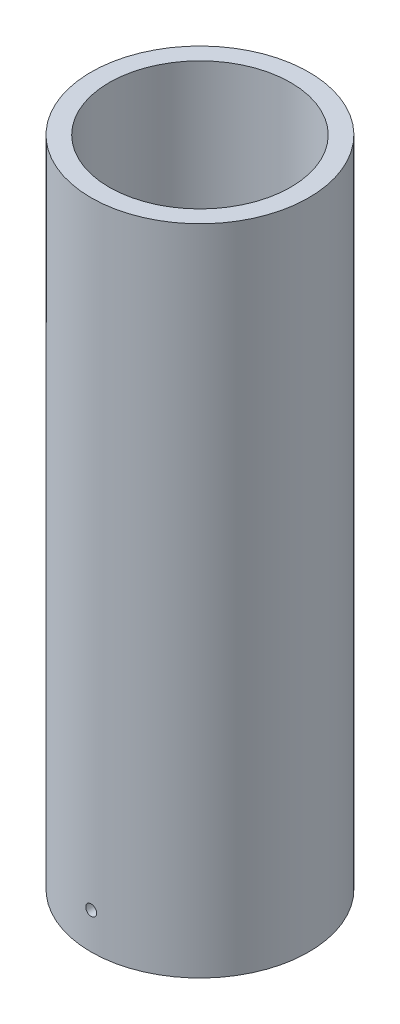
ISO-10303-21;
HEADER;
FILE_DESCRIPTION(('STEP AP214'),'2;1');
FILE_NAME('part.step','',(''),(''),'','','');
FILE_SCHEMA(('AUTOMOTIVE_DESIGN { 1 0 10303 214 1 1 1 1 }'));
ENDSEC;
DATA;
#1=APPLICATION_CONTEXT('core data for automotive mechanical design processes');
#2=APPLICATION_PROTOCOL_DEFINITION('international standard','automotive_design',2000,#1);
#3=PRODUCT_CONTEXT('',#1,'mechanical');
#4=PRODUCT('Part','Part','',(#3));
#5=PRODUCT_RELATED_PRODUCT_CATEGORY('part','',(#4));
#6=PRODUCT_DEFINITION_FORMATION('','',#4);
#7=PRODUCT_DEFINITION_CONTEXT('part definition',#1,'design');
#8=PRODUCT_DEFINITION('design','',#6,#7);
#9=PRODUCT_DEFINITION_SHAPE('','',#8);
#10=(LENGTH_UNIT() NAMED_UNIT(*) SI_UNIT(.MILLI.,.METRE.));
#11=(NAMED_UNIT(*) PLANE_ANGLE_UNIT() SI_UNIT($,.RADIAN.));
#12=(NAMED_UNIT(*) SI_UNIT($,.STERADIAN.) SOLID_ANGLE_UNIT());
#13=UNCERTAINTY_MEASURE_WITH_UNIT(LENGTH_MEASURE(1.E-05),#10,'distance_accuracy_value','');
#14=(GEOMETRIC_REPRESENTATION_CONTEXT(3) GLOBAL_UNCERTAINTY_ASSIGNED_CONTEXT((#13)) GLOBAL_UNIT_ASSIGNED_CONTEXT((#10,
#11,#12)) REPRESENTATION_CONTEXT('',''));
#15=CARTESIAN_POINT('',(0.,0.,0.));
#16=DIRECTION('',(0.,0.,1.));
#17=DIRECTION('',(1.,0.,0.));
#18=AXIS2_PLACEMENT_3D('',#15,#16,#17);
#19=CARTESIAN_POINT('',(0.,180.,0.));
#20=DIRECTION('',(0.,1.,0.));
#21=DIRECTION('',(0.,0.,1.));
#22=AXIS2_PLACEMENT_3D('',#19,#20,#21);
#23=PLANE('',#22);
#24=CARTESIAN_POINT('',(0.,180.,0.));
#25=DIRECTION('',(0.,1.,0.));
#26=DIRECTION('',(0.,0.,1.));
#27=AXIS2_PLACEMENT_3D('',#24,#25,#26);
#28=CIRCLE('',#27,30.);
#29=CARTESIAN_POINT('',(0.,180.,30.));
#30=VERTEX_POINT('',#29);
#31=EDGE_CURVE('E10',#30,#30,#28,.T.);
#32=ORIENTED_EDGE('',*,*,#31,.T.);
#33=EDGE_LOOP('',(#32));
#34=FACE_BOUND('',#33,.T.);
#35=CARTESIAN_POINT('',(0.,180.,0.));
#36=DIRECTION('',(0.,1.,0.));
#37=DIRECTION('',(0.,0.,1.));
#38=AXIS2_PLACEMENT_3D('',#35,#36,#37);
#39=CIRCLE('',#38,25.);
#40=CARTESIAN_POINT('',(0.,180.,25.));
#41=VERTEX_POINT('',#40);
#42=EDGE_CURVE('E49',#41,#41,#39,.T.);
#43=ORIENTED_EDGE('',*,*,#42,.F.);
#44=EDGE_LOOP('',(#43));
#45=FACE_BOUND('',#44,.T.);
#46=ADVANCED_FACE('F31',(#34,#45),#23,.T.);
#47=CARTESIAN_POINT('',(0.,0.,0.));
#48=DIRECTION('',(0.,1.,0.));
#49=DIRECTION('',(0.,0.,1.));
#50=AXIS2_PLACEMENT_3D('',#47,#48,#49);
#51=PLANE('',#50);
#52=CARTESIAN_POINT('',(0.,0.,0.));
#53=DIRECTION('',(0.,1.,0.));
#54=DIRECTION('',(0.,0.,1.));
#55=AXIS2_PLACEMENT_3D('',#52,#53,#54);
#56=CIRCLE('',#55,30.);
#57=CARTESIAN_POINT('',(0.,0.,30.));
#58=VERTEX_POINT('',#57);
#59=EDGE_CURVE('E44',#58,#58,#56,.T.);
#60=ORIENTED_EDGE('',*,*,#59,.F.);
#61=EDGE_LOOP('',(#60));
#62=FACE_BOUND('',#61,.T.);
#63=CARTESIAN_POINT('',(0.,0.,0.));
#64=DIRECTION('',(0.,1.,0.));
#65=DIRECTION('',(0.,0.,1.));
#66=AXIS2_PLACEMENT_3D('',#63,#64,#65);
#67=CIRCLE('',#66,25.);
#68=CARTESIAN_POINT('',(0.,0.,25.));
#69=VERTEX_POINT('',#68);
#70=EDGE_CURVE('E52',#69,#69,#67,.T.);
#71=ORIENTED_EDGE('',*,*,#70,.T.);
#72=EDGE_LOOP('',(#71));
#73=FACE_BOUND('',#72,.T.);
#74=ADVANCED_FACE('F85',(#62,#73),#51,.F.);
#75=CARTESIAN_POINT('',(0.,180.,0.));
#76=DIRECTION('',(0.,-1.,0.));
#77=DIRECTION('',(0.,0.,-1.));
#78=AXIS2_PLACEMENT_3D('',#75,#76,#77);
#79=CYLINDRICAL_SURFACE('',#78,30.);
#80=CARTESIAN_POINT('',(0.,11.5,-30.));
#81=CARTESIAN_POINT('',(-0.0841992126832857,11.4999962840397,-29.9999994982941));
#82=CARTESIAN_POINT('',(-0.168458136850032,11.4928866817366,-29.9996417281926));
#83=CARTESIAN_POINT('',(-0.33465158022757,11.4646258947893,-29.9982489069002));
#84=CARTESIAN_POINT('',(-0.416583242008779,11.4434581659315,-29.9972130577371));
#85=CARTESIAN_POINT('',(-0.575690637565501,11.3876886958403,-29.994581319066));
#86=CARTESIAN_POINT('',(-0.652868771917124,11.3530938009858,-29.9929857150113));
#87=CARTESIAN_POINT('',(-0.800301559187852,11.2714625403052,-29.9894141701653));
#88=CARTESIAN_POINT('',(-0.870557841111931,11.2244291114388,-29.987438319187));
#89=CARTESIAN_POINT('',(-1.00224448930937,11.1192029919437,-29.9833263203305));
#90=CARTESIAN_POINT('',(-1.06366700108493,11.0610004763932,-29.9811900323378));
#91=CARTESIAN_POINT('',(-1.1758756183212,10.935107951495,-29.9769991403279));
#92=CARTESIAN_POINT('',(-1.22666128928588,10.8674175547728,-29.9749445396501));
#93=CARTESIAN_POINT('',(-1.3161762583419,10.7244295509778,-29.9711477201023));
#94=CARTESIAN_POINT('',(-1.35489942324752,10.6491280997483,-29.969405660334));
#95=CARTESIAN_POINT('',(-1.41915082297219,10.4930825776006,-29.9664320766967));
#96=CARTESIAN_POINT('',(-1.44467915792307,10.4123385479899,-29.9652005489535));
#97=CARTESIAN_POINT('',(-1.4817954922831,10.2477721448386,-29.9633881722544));
#98=CARTESIAN_POINT('',(-1.4933952428733,10.1639524277984,-29.9628067748292));
#99=CARTESIAN_POINT('',(-1.5023613905524,9.99555366389491,-29.9623585750058));
#100=CARTESIAN_POINT('',(-1.49972789996418,9.9109746230292,-29.9624917669684));
#101=CARTESIAN_POINT('',(-1.48031211001844,9.74353797565118,-29.9634572162788));
#102=CARTESIAN_POINT('',(-1.46354250774894,9.66067889267851,-29.9642888462857));
#103=CARTESIAN_POINT('',(-1.41635019807595,9.49895332894273,-29.9665564507146));
#104=CARTESIAN_POINT('',(-1.38592743297957,9.42008686505241,-29.9679924276905));
#105=CARTESIAN_POINT('',(-1.31227788828427,9.26854436690631,-29.9713076019097));
#106=CARTESIAN_POINT('',(-1.26904531998985,9.19587115051146,-29.9731869994545));
#107=CARTESIAN_POINT('',(-1.17100760081353,9.05880889495858,-29.9771769840148));
#108=CARTESIAN_POINT('',(-1.11620236826096,8.99441991426925,-29.9792875726618));
#109=CARTESIAN_POINT('',(-0.996503387931563,8.87567999508416,-29.9835048437456));
#110=CARTESIAN_POINT('',(-0.931598644778624,8.82134013991281,-29.9856115193623));
#111=CARTESIAN_POINT('',(-0.793581693926331,8.72432638662726,-29.9895812923529));
#112=CARTESIAN_POINT('',(-0.720469484208145,8.68165249138259,-29.9914443896669));
#113=CARTESIAN_POINT('',(-0.568106505265407,8.60918307666531,-29.9947171137912));
#114=CARTESIAN_POINT('',(-0.488855551783037,8.5793879439327,-29.9961267269834));
#115=CARTESIAN_POINT('',(-0.326467606273836,8.53352907355052,-29.9983334185069));
#116=CARTESIAN_POINT('',(-0.243330643343608,8.51746523310486,-29.9991305014237));
#117=CARTESIAN_POINT('',(-0.0756268510814774,8.49953860112713,-30.0000217103255));
#118=CARTESIAN_POINT('',(0.00893833568201768,8.49766047938959,-30.0001165951587));
#119=CARTESIAN_POINT('',(0.177182660650749,8.50811859109897,-29.9995947289365));
#120=CARTESIAN_POINT('',(0.260861801785493,8.52045477753472,-29.9989779802346));
#121=CARTESIAN_POINT('',(0.424915732818912,8.55897863792114,-29.9971028015194));
#122=CARTESIAN_POINT('',(0.505292170445178,8.58515931212933,-29.9958446957863));
#123=CARTESIAN_POINT('',(0.660509858247266,8.65062187780918,-29.992828448663));
#124=CARTESIAN_POINT('',(0.735351076557828,8.68990384469545,-29.9910703043943));
#125=CARTESIAN_POINT('',(0.87744424784483,8.78049317325427,-29.9872498726375));
#126=CARTESIAN_POINT('',(0.94468964221621,8.83181081127804,-29.9851873258042));
#127=CARTESIAN_POINT('',(1.06961637025234,8.94499974827068,-29.9809912358893));
#128=CARTESIAN_POINT('',(1.12729764255457,9.00687111494613,-29.9788576923523));
#129=CARTESIAN_POINT('',(1.2315103771602,9.13947715629033,-29.9747579179097));
#130=CARTESIAN_POINT('',(1.27803192066247,9.21021963122791,-29.9727918368387));
#131=CARTESIAN_POINT('',(1.35853682885391,9.35852035428337,-29.9692510482457));
#132=CARTESIAN_POINT('',(1.39252024811012,9.43607857273672,-29.9676763390205));
#133=CARTESIAN_POINT('',(1.44696694942588,9.59577244253631,-29.9650969361268));
#134=CARTESIAN_POINT('',(1.46743655476016,9.67790593352137,-29.9640919758971));
#135=CARTESIAN_POINT('',(1.49429525271083,9.84444911401301,-29.9627646470903));
#136=CARTESIAN_POINT('',(1.50068442526798,9.92885879059394,-29.9624422746379));
#137=CARTESIAN_POINT('',(1.49920013162778,10.0974595236451,-29.9625165709538));
#138=CARTESIAN_POINT('',(1.49134226953531,10.1816507182812,-29.9629124530521));
#139=CARTESIAN_POINT('',(1.46161921750531,10.3475169829771,-29.9643769772704));
#140=CARTESIAN_POINT('',(1.43975400087197,10.4291920482411,-29.9654456206724));
#141=CARTESIAN_POINT('',(1.38264009901717,10.5877108698946,-29.968135046136));
#142=CARTESIAN_POINT('',(1.34739131557652,10.6645545908229,-29.9697558322496));
#143=CARTESIAN_POINT('',(1.2645135593488,10.8112343250962,-29.9733668169471));
#144=CARTESIAN_POINT('',(1.21688496641684,10.8810705533641,-29.9753570041959));
#145=CARTESIAN_POINT('',(1.11054372547874,11.0118308417719,-29.9794849660002));
#146=CARTESIAN_POINT('',(1.05182020091046,11.0727460515701,-29.9816228840632));
#147=CARTESIAN_POINT('',(0.924963179847304,11.1838725394719,-29.9858043365659));
#148=CARTESIAN_POINT('',(0.856827371947794,11.2340811806016,-29.9878478476567));
#149=CARTESIAN_POINT('',(0.713026426964387,11.322392770467,-29.9916116284693));
#150=CARTESIAN_POINT('',(0.637354138093169,11.3604840738536,-29.9933315865963));
#151=CARTESIAN_POINT('',(0.480736308807686,11.4233754378123,-29.9962497906235));
#152=CARTESIAN_POINT('',(0.39979712443394,11.4481911973825,-29.9974486524302));
#153=CARTESIAN_POINT('',(0.265295889027319,11.4773178227492,-29.9988724803088));
#154=CARTESIAN_POINT('',(0.212605024212695,11.485812779862,-29.9992934419966));
#155=CARTESIAN_POINT('',(0.10661742125844,11.4971550426777,-29.9998573605808));
#156=CARTESIAN_POINT('',(0.0533206836358208,11.5000023531996,-30.0000003177144));
#157=CARTESIAN_POINT('',(0.,11.5,-30.));
#158=B_SPLINE_CURVE_WITH_KNOTS('',3,(#80,#81,#82,#83,#84,#85,#86,#87,#88,#89,#90,#91,#92,#93,
#94,#95,#96,#97,#98,#99,#100,#101,#102,#103,#104,#105,#106,#107,#108,#109,#110,#111,#112,#113,
#114,#115,#116,#117,#118,#119,#120,#121,#122,#123,#124,#125,#126,#127,#128,#129,#130,#131,#132,
#133,#134,#135,#136,#137,#138,#139,#140,#141,#142,#143,#144,#145,#146,#147,#148,#149,#150,#151,
#152,#153,#154,#155,#156,#157),.UNSPECIFIED.,.T.,.F.,(4,2,2,2,2,2,2,2,2,2,2,2,2,2,2,2,2,2,2,2,2,
2,2,2,2,2,2,2,2,2,2,2,2,2,2,2,2,2,4),(0.,0.252402997656368,0.505103561718776,0.757675445181304,
1.01018774508169,1.26292319493205,1.51566896656381,1.76854303790938,2.02141519023714,
2.27407385073242,2.52673051735232,2.7791604886842,3.03159152669597,3.28413681164744,
3.53668387892216,3.78950784409648,4.04233187145931,4.29516349041915,4.5479932165984,
4.80054967590646,5.05310529993359,5.30553335431042,5.55796286175701,5.8106086894383,
6.06325613800909,6.31612731523398,6.56899739192782,6.82174906367759,7.07449930044228,
7.32697287900311,7.57944693874014,7.83192285136708,8.08439101807935,8.33710798029887,
8.58988711372659,8.84290845133273,9.09562991333956,9.25546884106144,9.41530763239779),.UNSPECIFIED.);
#159=CARTESIAN_POINT('',(0.,11.5,-30.));
#160=VERTEX_POINT('',#159);
#161=EDGE_CURVE('E75',#160,#160,#158,.T.);
#162=ORIENTED_EDGE('',*,*,#161,.T.);
#163=EDGE_LOOP('',(#162));
#164=FACE_BOUND('',#163,.T.);
#165=CARTESIAN_POINT('',(1.5,10.,29.9624765331573));
#166=CARTESIAN_POINT('',(1.49999628397222,9.91580086150497,29.9624770372162));
#167=CARTESIAN_POINT('',(1.49288669377387,9.83154201127373,29.962835266608));
#168=CARTESIAN_POINT('',(1.46462595928152,9.66534872152329,29.9642297287393));
#169=CARTESIAN_POINT('',(1.44345827052283,9.58341713949153,29.9652667603156));
#170=CARTESIAN_POINT('',(1.38768891775242,9.42430991251044,29.9679010652108));
#171=CARTESIAN_POINT('',(1.35309410203283,9.34713186630945,29.9694980528928));
#172=CARTESIAN_POINT('',(1.271463027665,9.19969922652003,29.9730719610605));
#173=CARTESIAN_POINT('',(1.22442970578001,9.12944300403836,29.975048791834));
#174=CARTESIAN_POINT('',(1.1192036939777,8.99775628782395,29.9791619233031));
#175=CARTESIAN_POINT('',(1.06100115527481,8.93633366763087,29.9812983637162));
#176=CARTESIAN_POINT('',(0.93510853867131,8.82412484140337,29.985488661235));
#177=CARTESIAN_POINT('',(0.867418073690438,8.77333906953291,29.9875425149671));
#178=CARTESIAN_POINT('',(0.724430010979663,8.68382399565718,29.9913372650751));
#179=CARTESIAN_POINT('',(0.649128580822738,8.64510080811049,29.9930780025459));
#180=CARTESIAN_POINT('',(0.493083104497863,8.58084936070071,29.9960489494894));
#181=CARTESIAN_POINT('',(0.412339099524103,8.55532100098023,29.9972791628257));
#182=CARTESIAN_POINT('',(0.247772768188905,8.51820461382668,29.9990894967281));
#183=CARTESIAN_POINT('',(0.163953098728565,8.50660483340009,29.9996701653544));
#184=CARTESIAN_POINT('',(-0.00444557228203016,8.49763860956657,30.0001178121798));
#185=CARTESIAN_POINT('',(-0.0890245678515672,8.50027205415178,29.9999847959953));
#186=CARTESIAN_POINT('',(-0.256461420139639,8.51968777202017,29.9990205243754));
#187=CARTESIAN_POINT('',(-0.339320747918154,8.53645739450254,29.9981898932546));
#188=CARTESIAN_POINT('',(-0.501046790855104,8.58364982975444,29.9959246714313));
#189=CARTESIAN_POINT('',(-0.579913489272554,8.61407269976638,29.9944900781967));
#190=CARTESIAN_POINT('',(-0.731456268769944,8.68772246012796,29.991177454681));
#191=CARTESIAN_POINT('',(-0.804129544029277,8.73095511443547,29.9892992248562));
#192=CARTESIAN_POINT('',(-0.941191880683595,8.82899301635359,29.9853108458067));
#193=CARTESIAN_POINT('',(-1.00558088357129,8.88379834568847,29.9832006949442));
#194=CARTESIAN_POINT('',(-1.12432069061591,9.00349739374138,29.978983382249));
#195=CARTESIAN_POINT('',(-1.178660431069,9.06840208831534,29.9768762262153));
#196=CARTESIAN_POINT('',(-1.27567397617904,9.2064189014372,29.9729047794271));
#197=CARTESIAN_POINT('',(-1.31834777773623,9.27953102216589,29.9710404887371));
#198=CARTESIAN_POINT('',(-1.39081712539269,9.43189397898568,29.9677651844501));
#199=CARTESIAN_POINT('',(-1.42061225547781,9.51114501328194,29.966354185496));
#200=CARTESIAN_POINT('',(-1.46647109571371,9.67353313415029,29.9641451427563));
#201=CARTESIAN_POINT('',(-1.48253490913895,9.75667019149029,29.9633470943607));
#202=CARTESIAN_POINT('',(-1.50046143951967,9.92437402449913,29.9624548008175));
#203=CARTESIAN_POINT('',(-1.50233951237468,10.008939154846,29.9623597946373));
#204=CARTESIAN_POINT('',(-1.49188132304581,10.1771833551685,29.9628823125091));
#205=CARTESIAN_POINT('',(-1.47954510786832,10.2608624280734,29.9634998342048));
#206=CARTESIAN_POINT('',(-1.44102125848948,10.4249160357454,29.9653771125877));
#207=CARTESIAN_POINT('',(-1.41484065287852,10.5052922250422,29.9666365433754));
#208=CARTESIAN_POINT('',(-1.34937830775901,10.6605094466212,29.9696554135577));
#209=CARTESIAN_POINT('',(-1.31009649243498,10.7353504468688,29.9714148558457));
#210=CARTESIAN_POINT('',(-1.21950738416592,10.8774434744792,29.9752372960101));
#211=CARTESIAN_POINT('',(-1.16818977630626,10.9446889186455,29.9773005536947));
#212=CARTESIAN_POINT('',(-1.05500087152025,11.0696157612423,29.981497160644));
#213=CARTESIAN_POINT('',(-0.993129507121334,11.1272970985227,29.9836305103568));
#214=CARTESIAN_POINT('',(-0.860523436418344,11.2315099665688,29.9877290769785));
#215=CARTESIAN_POINT('',(-0.789780929636859,11.2780315783069,29.9896941433233));
#216=CARTESIAN_POINT('',(-0.641480125358402,11.3585366063708,29.9932325258126));
#217=CARTESIAN_POINT('',(-0.563921857527848,11.3925200772669,29.994805843662));
#218=CARTESIAN_POINT('',(-0.40422802456372,11.4469668143062,29.9973826962819));
#219=CARTESIAN_POINT('',(-0.322094627416059,11.4674364260568,29.9983864984446));
#220=CARTESIAN_POINT('',(-0.155551644264921,11.4942951686611,29.9997122550948));
#221=CARTESIAN_POINT('',(-0.0711420711067391,11.500684378959,30.0000342134294));
#222=CARTESIAN_POINT('',(0.0974587323412745,11.4992001924303,29.9999600152463));
#223=CARTESIAN_POINT('',(0.181650100387103,11.4913423547829,29.999564642125));
#224=CARTESIAN_POINT('',(0.347516717827452,11.4616192904981,29.9981018331539));
#225=CARTESIAN_POINT('',(0.429191962482231,11.439754037476,29.9970343960382));
#226=CARTESIAN_POINT('',(0.587711133113285,11.3826399984748,29.9943475524905));
#227=CARTESIAN_POINT('',(0.664555023593041,11.347391114178,29.9927281420037));
#228=CARTESIAN_POINT('',(0.81123505466916,11.2645131039952,29.9891194758232));
#229=CARTESIAN_POINT('',(0.881071410292449,11.2168843581477,29.9871302314832));
#230=CARTESIAN_POINT('',(1.01183168334708,11.1105429523416,29.9830033176299));
#231=CARTESIAN_POINT('',(1.07274677865547,11.0518194505526,29.9808655042371));
#232=CARTESIAN_POINT('',(1.18387304623981,10.9249625216858,29.9766833697048));
#233=CARTESIAN_POINT('',(1.23408158124698,10.8568267829553,29.9746390716975));
#234=CARTESIAN_POINT('',(1.32239306067115,10.7130258909328,29.9708731658307));
#235=CARTESIAN_POINT('',(1.3604843396651,10.6373535735403,29.9691518695786));
#236=CARTESIAN_POINT('',(1.42337565004508,10.4807356831098,29.9662310322912));
#237=CARTESIAN_POINT('',(1.44819138081059,10.3997964662724,29.9650308752857));
#238=CARTESIAN_POINT('',(1.4773179225833,10.2652953083114,29.9636054274165));
#239=CARTESIAN_POINT('',(1.48581284214325,10.2126045593118,29.9631839590812));
#240=CARTESIAN_POINT('',(1.49715505505153,10.106617188546,29.9626193524688));
#241=CARTESIAN_POINT('',(1.50000235323915,10.0533205672991,29.9624762139532));
#242=CARTESIAN_POINT('',(1.5,10.,29.9624765331573));
#243=B_SPLINE_CURVE_WITH_KNOTS('',3,(#165,#166,#167,#168,#169,#170,#171,#172,#173,#174,#175,
#176,#177,#178,#179,#180,#181,#182,#183,#184,#185,#186,#187,#188,#189,#190,#191,#192,#193,#194,
#195,#196,#197,#198,#199,#200,#201,#202,#203,#204,#205,#206,#207,#208,#209,#210,#211,#212,#213,
#214,#215,#216,#217,#218,#219,#220,#221,#222,#223,#224,#225,#226,#227,#228,#229,#230,#231,#232,
#233,#234,#235,#236,#237,#238,#239,#240,#241,#242),.UNSPECIFIED.,.T.,.F.,(4,2,2,2,2,2,2,2,2,2,2,
2,2,2,2,2,2,2,2,2,2,2,2,2,2,2,2,2,2,2,2,2,2,2,2,2,2,2,4),(0.,0.252402774850887,
0.505103120966063,0.757674750307552,1.01018679999478,1.2629225413087,1.51566859652119,
1.76854255964547,2.02141460901224,2.27407313360386,2.52672966991109,2.77916033764387,
3.03159206372378,3.28413754825082,3.53668481627066,3.78950849136502,4.04233223363706,
4.29516414215493,4.54799414908479,4.80055043119031,5.05310587809921,5.30553322930183,
5.55796204130353,5.81060798549991,6.06325554497973,6.3161268383656,6.5689970311533,
6.82174840085848,7.0744983444935,7.32697242654597,7.57944698416684,7.83192339653087,
8.08439205925959,8.33710872331969,8.58988756550599,8.84290902947146,9.09563061048889,
9.2554691897848,9.415307632119),.UNSPECIFIED.);
#244=CARTESIAN_POINT('',(1.5,10.,29.9624765331573));
#245=VERTEX_POINT('',#244);
#246=EDGE_CURVE('E71',#245,#245,#243,.T.);
#247=ORIENTED_EDGE('',*,*,#246,.T.);
#248=EDGE_LOOP('',(#247));
#249=FACE_BOUND('',#248,.T.);
#250=ORIENTED_EDGE('',*,*,#31,.F.);
#251=EDGE_LOOP('',(#250));
#252=FACE_BOUND('',#251,.T.);
#253=ORIENTED_EDGE('',*,*,#59,.T.);
#254=EDGE_LOOP('',(#253));
#255=FACE_BOUND('',#254,.T.);
#256=ADVANCED_FACE('F33',(#164,#249,#252,#255),#79,.T.);
#257=CARTESIAN_POINT('',(0.,180.,0.));
#258=DIRECTION('',(0.,-1.,0.));
#259=DIRECTION('',(0.,0.,-1.));
#260=AXIS2_PLACEMENT_3D('',#257,#258,#259);
#261=CYLINDRICAL_SURFACE('',#260,25.);
#262=CARTESIAN_POINT('',(0.,11.5,-25.));
#263=CARTESIAN_POINT('',(-0.0841744112906973,11.499996293818,-24.9999994009396));
#264=CARTESIAN_POINT('',(-0.168407925575417,11.4928908622938,-24.9995703322505));
#265=CARTESIAN_POINT('',(-0.33454954923528,11.4646476084302,-24.9978999420123));
#266=CARTESIAN_POINT('',(-0.41645482833071,11.4434934098783,-24.9966576725644));
#267=CARTESIAN_POINT('',(-0.575509331027304,11.3877619851162,-24.9935014300757));
#268=CARTESIAN_POINT('',(-0.652661020509568,11.3531917874331,-24.9915878088006));
#269=CARTESIAN_POINT('',(-0.800046136146105,11.2716209519445,-24.9873041548427));
#270=CARTESIAN_POINT('',(-0.870281152186776,11.2246231799728,-24.9849342274195));
#271=CARTESIAN_POINT('',(-1.00195727834146,11.1194594271275,-24.9800007098428));
#272=CARTESIAN_POINT('',(-1.06338750728241,11.0612798317275,-24.9774368859408));
#273=CARTESIAN_POINT('',(-1.17561728443769,10.935431850684,-24.9724065327507));
#274=CARTESIAN_POINT('',(-1.22641639063195,10.867763070695,-24.9699400075116));
#275=CARTESIAN_POINT('',(-1.31597486784904,10.7247967217378,-24.9653806252969));
#276=CARTESIAN_POINT('',(-1.35472528905779,10.6494935366959,-24.9632880465787));
#277=CARTESIAN_POINT('',(-1.41902912258917,10.4934353604241,-24.9597155336563));
#278=CARTESIAN_POINT('',(-1.44458266771712,10.4126804240666,-24.9582355932868));
#279=CARTESIAN_POINT('',(-1.48173741565119,10.2481151420652,-24.9560574575134));
#280=CARTESIAN_POINT('',(-1.49335553999938,10.1643086296343,-24.9553583140724));
#281=CARTESIAN_POINT('',(-1.50236188160073,9.99593222010211,-24.954817773996));
#282=CARTESIAN_POINT('',(-1.49975024936642,9.91136233108476,-24.954976368288));
#283=CARTESIAN_POINT('',(-1.48038526467146,9.74397503742043,-24.9561325386846));
#284=CARTESIAN_POINT('',(-1.46365021721639,9.66115550653041,-24.9571290288072));
#285=CARTESIAN_POINT('',(-1.41654183568936,9.49950324083169,-24.9598469788447));
#286=CARTESIAN_POINT('',(-1.38616842513186,9.42067052838429,-24.9615684428253));
#287=CARTESIAN_POINT('',(-1.31262469930025,9.2691708267964,-24.9655435872457));
#288=CARTESIAN_POINT('',(-1.26944607125189,9.1965078824264,-24.9677976132153));
#289=CARTESIAN_POINT('',(-1.17152362364147,9.05945457537002,-24.9725835122349));
#290=CARTESIAN_POINT('',(-1.11677968459202,8.99506429816404,-24.9751153881552));
#291=CARTESIAN_POINT('',(-0.997177453913968,8.87627761892122,-24.9801764756538));
#292=CARTESIAN_POINT('',(-0.932303318346461,8.82189716787369,-24.9827056767018));
#293=CARTESIAN_POINT('',(-0.794337807078351,8.72479681289598,-24.9874725341813));
#294=CARTESIAN_POINT('',(-0.721246428711386,8.68207691274946,-24.9897101905182));
#295=CARTESIAN_POINT('',(-0.568911628096272,8.60951170999266,-24.9936419598513));
#296=CARTESIAN_POINT('',(-0.489667922304732,8.57966700117968,-24.9953360477775));
#297=CARTESIAN_POINT('',(-0.327282186584158,8.5337099684282,-24.9979894319355));
#298=CARTESIAN_POINT('',(-0.244140198631619,8.5175974966575,-24.9989487360774));
#299=CARTESIAN_POINT('',(-0.0764564081212676,8.4995820540376,-25.0000234317371));
#300=CARTESIAN_POINT('',(0.00808301680837901,8.49765702742457,-25.000140133157));
#301=CARTESIAN_POINT('',(0.176283598525669,8.50801350654288,-24.9995199551995));
#302=CARTESIAN_POINT('',(0.259944759518493,8.52029494422147,-24.998783079911));
#303=CARTESIAN_POINT('',(0.423951918612621,8.55869746639442,-24.9965395546253));
#304=CARTESIAN_POINT('',(0.504300292000613,8.58480844226628,-24.9950334669082));
#305=CARTESIAN_POINT('',(0.659474362375062,8.65011858331961,-24.991420983828));
#306=CARTESIAN_POINT('',(0.734300013552596,8.68931785704872,-24.9893145834861));
#307=CARTESIAN_POINT('',(0.876405673907386,8.77974808630051,-24.9847349543981));
#308=CARTESIAN_POINT('',(0.943676287014675,8.83099378415315,-24.9822612775589));
#309=CARTESIAN_POINT('',(1.06866774190153,8.94404070840916,-24.9772270256052));
#310=CARTESIAN_POINT('',(1.12638849680831,9.00584203082413,-24.9746664497003));
#311=CARTESIAN_POINT('',(1.23071636822773,9.13834098829924,-24.9697432142549));
#312=CARTESIAN_POINT('',(1.27730918435509,9.20904989414342,-24.9673808118859));
#313=CARTESIAN_POINT('',(1.35796077823129,9.35730014010787,-24.9631244152043));
#314=CARTESIAN_POINT('',(1.3920196283509,9.43484144077489,-24.9612304181871));
#315=CARTESIAN_POINT('',(1.44661168369628,9.59450296761392,-24.9581262710517));
#316=CARTESIAN_POINT('',(1.46715391475467,9.67662009841355,-24.9569156646707));
#317=CARTESIAN_POINT('',(1.49415910044394,9.84314534845835,-24.9553135506001));
#318=CARTESIAN_POINT('',(1.50062218175197,9.92755344708362,-24.9549220355407));
#319=CARTESIAN_POINT('',(1.49928439559964,10.0961223748444,-24.9550024337275));
#320=CARTESIAN_POINT('',(1.4915060131671,10.1802833839978,-24.955472985906));
#321=CARTESIAN_POINT('',(1.46195268745906,10.3461021246323,-24.9572216088909));
#322=CARTESIAN_POINT('',(1.44017771850783,10.4277598515209,-24.9584996811785));
#323=CARTESIAN_POINT('',(1.38325430313316,10.586257712021,-24.9617189844004));
#324=CARTESIAN_POINT('',(1.34810590374647,10.6630978625757,-24.9636602130021));
#325=CARTESIAN_POINT('',(1.26543658450866,10.8097889837536,-24.9679870227359));
#326=CARTESIAN_POINT('',(1.21791599798011,10.8796401425991,-24.9703725918963));
#327=CARTESIAN_POINT('',(1.11176851558594,11.0104842139973,-24.9753236195898));
#328=CARTESIAN_POINT('',(1.05312545630152,11.0714640037111,-24.9778893364568));
#329=CARTESIAN_POINT('',(0.926417671082018,11.1827340813544,-24.9829093861692));
#330=CARTESIAN_POINT('',(0.858350640782176,11.2330217471789,-24.9853636915766));
#331=CARTESIAN_POINT('',(0.714654868135349,11.321514157026,-24.9898867196811));
#332=CARTESIAN_POINT('',(0.639017327934047,11.3597046229485,-24.9919549855695));
#333=CARTESIAN_POINT('',(0.482446674586146,11.4227975817096,-24.9954666177913));
#334=CARTESIAN_POINT('',(0.401519900921801,11.4477156659503,-24.9969107169712));
#335=CARTESIAN_POINT('',(0.266746945425284,11.4770671292626,-24.9986320978355));
#336=CARTESIAN_POINT('',(0.213772324734721,11.4856558662585,-24.9991427869583));
#337=CARTESIAN_POINT('',(0.107206461740469,11.4971234783516,-24.9998269286143));
#338=CARTESIAN_POINT('',(0.0536152202163843,11.5000023606671,-25.0000003815739));
#339=CARTESIAN_POINT('',(0.,11.5,-25.));
#340=B_SPLINE_CURVE_WITH_KNOTS('',3,(#262,#263,#264,#265,#266,#267,#268,#269,#270,#271,#272,
#273,#274,#275,#276,#277,#278,#279,#280,#281,#282,#283,#284,#285,#286,#287,#288,#289,#290,#291,
#292,#293,#294,#295,#296,#297,#298,#299,#300,#301,#302,#303,#304,#305,#306,#307,#308,#309,#310,
#311,#312,#313,#314,#315,#316,#317,#318,#319,#320,#321,#322,#323,#324,#325,#326,#327,#328,#329,
#330,#331,#332,#333,#334,#335,#336,#337,#338,#339),.UNSPECIFIED.,.T.,.F.,(4,2,2,2,2,2,2,2,2,2,2,
2,2,2,2,2,2,2,2,2,2,2,2,2,2,2,2,2,2,2,2,2,2,2,2,2,2,2,4),(0.,0.252327509077057,0.50494966599295,
0.757439654594852,1.00987146898756,1.26261260362568,1.51536424463011,1.76830318456221,
2.02123957902125,2.2738685252172,2.52649479928369,2.77879415269304,3.03109492104444,
3.28355983557363,3.5360273585799,3.78889377835761,4.04176028018661,4.29463844284425,
4.54751388314839,4.79999612089073,5.05247714918094,5.30477388207097,5.55707270743328,
5.80968191670639,6.06229342377881,6.31522783298447,6.56816078173093,6.82092466056902,
7.07368626515456,7.32604914306343,7.57841248391497,7.83077493716774,8.08313059215601,
8.33585582543017,8.58864296499112,8.84172736228352,9.0945137955507,9.25523499170707,
9.41595598468315),.UNSPECIFIED.);
#341=CARTESIAN_POINT('',(0.,11.5,-25.));
#342=VERTEX_POINT('',#341);
#343=EDGE_CURVE('E36',#342,#342,#340,.T.);
#344=ORIENTED_EDGE('',*,*,#343,.F.);
#345=EDGE_LOOP('',(#344));
#346=FACE_BOUND('',#345,.T.);
#347=CARTESIAN_POINT('',(1.5,10.,24.9549594269356));
#348=CARTESIAN_POINT('',(1.49999629367853,9.91582574249602,24.9549600300317));
#349=CARTESIAN_POINT('',(1.49289088723917,9.83159238147982,24.9553898919632));
#350=CARTESIAN_POINT('',(1.46464774207902,9.6654510762883,24.9570631163396));
#351=CARTESIAN_POINT('',(1.44349362662339,9.58354596251271,24.9583074281733));
#352=CARTESIAN_POINT('',(1.38776244497562,9.42449180928827,24.9614681027881));
#353=CARTESIAN_POINT('',(1.35319241127323,9.34734030255802,24.9633841134208));
#354=CARTESIAN_POINT('',(1.27162196187011,9.19995549274731,24.9676718488877));
#355=CARTESIAN_POINT('',(1.22462441159698,9.12972060001151,24.9700434686372));
#356=CARTESIAN_POINT('',(1.11946088204271,8.99804433305085,24.9749789472156));
#357=CARTESIAN_POINT('',(1.06128123877002,8.93661387943003,24.9775430388755));
#358=CARTESIAN_POINT('',(0.935433067856954,8.8243836690896,24.9825723731579));
#359=CARTESIAN_POINT('',(0.867764146481715,8.77358435370169,24.9850376116732));
#360=CARTESIAN_POINT('',(0.72479767520839,8.68402565895638,24.9895934208353));
#361=CARTESIAN_POINT('',(0.649494533535974,8.64527519065055,24.9916837136997));
#362=CARTESIAN_POINT('',(0.493436451566955,8.5809712580593,24.9952516671057));
#363=CARTESIAN_POINT('',(0.412681565907557,8.55541766153744,24.9967293337859));
#364=CARTESIAN_POINT('',(0.248116432778312,8.51826280439247,24.9989039357683));
#365=CARTESIAN_POINT('',(0.164310019372327,8.50664461835363,24.999601818096));
#366=CARTESIAN_POINT('',(-0.00406619674097704,8.49763811906782,25.0001414004183));
#367=CARTESIAN_POINT('',(-0.088635991399465,8.50024965596207,24.9999831094297));
#368=CARTESIAN_POINT('',(-0.25602370910129,8.51961449104253,24.9988289734266));
#369=CARTESIAN_POINT('',(-0.338843747190689,8.53634958015796,24.9978342068609));
#370=CARTESIAN_POINT('',(-0.500497005824335,8.58345822133699,24.9951203677711));
#371=CARTESIAN_POINT('',(-0.579330204279495,8.6138318489557,24.9934012912345));
#372=CARTESIAN_POINT('',(-0.730830489828712,8.68737602146978,24.9894305509762));
#373=CARTESIAN_POINT('',(-0.803493557011333,8.73055482803961,24.987178543607));
#374=CARTESIAN_POINT('',(-0.94054703371884,8.82847765519807,24.9823954231729));
#375=CARTESIAN_POINT('',(-1.00493735768537,8.8832217953822,24.9798643072219));
#376=CARTESIAN_POINT('',(-1.12372380476943,9.00282416709277,24.9748031593022));
#377=CARTESIAN_POINT('',(-1.1781040176493,9.06769820191484,24.972273135328));
#378=CARTESIAN_POINT('',(-1.27520394033667,9.20566342735352,24.9675033967138));
#379=CARTESIAN_POINT('',(-1.3179236458803,9.27875462097487,24.96526368218));
#380=CARTESIAN_POINT('',(-1.39048870924375,9.43108937503987,24.9613274543607));
#381=CARTESIAN_POINT('',(-1.42033341256492,9.51033324801242,24.9596309686913));
#382=CARTESIAN_POINT('',(-1.46629038294869,9.67271934659457,24.9569735139226));
#383=CARTESIAN_POINT('',(-1.48240279883676,9.75586152994541,24.9560125368521));
#384=CARTESIAN_POINT('',(-1.50041803122797,9.92354540576911,24.9549359603509));
#385=CARTESIAN_POINT('',(-1.502342956535,10.0080847148941,24.9548190455977));
#386=CARTESIAN_POINT('',(-1.49198631615381,10.1762850405415,24.9554403428122));
#387=CARTESIAN_POINT('',(-1.47970481851039,10.2599460612687,24.9561785506842));
#388=CARTESIAN_POINT('',(-1.44130231806505,10.4239525508928,24.9584256981138));
#389=CARTESIAN_POINT('',(-1.41519148386754,10.5043004092052,24.9599340713456));
#390=CARTESIAN_POINT('',(-1.34988179901679,10.6594735122598,24.9635510809282));
#391=CARTESIAN_POINT('',(-1.31068283898678,10.734298710843,24.9656597222954));
#392=CARTESIAN_POINT('',(-1.2202530665563,10.8764040714476,24.9702428271324));
#393=CARTESIAN_POINT('',(-1.16900743202449,10.9436747865983,24.9727177398586));
#394=CARTESIAN_POINT('',(-1.05596057652178,11.0686664769422,24.9777529022322));
#395=CARTESIAN_POINT('',(-0.994159260021297,11.1263873656994,24.9803131526518));
#396=CARTESIAN_POINT('',(-0.861660242357588,11.2307155140826,24.9852343171827));
#397=CARTESIAN_POINT('',(-0.790951269706829,11.2773084725469,24.9875949722934));
#398=CARTESIAN_POINT('',(-0.642700853338525,11.3579603164173,24.9918472173968));
#399=CARTESIAN_POINT('',(-0.565159449081161,11.3920192742066,24.9937388100983));
#400=CARTESIAN_POINT('',(-0.405497997606176,11.4466114035117,24.9968385433506));
#401=CARTESIAN_POINT('',(-0.323381061721332,11.4671536474445,24.9980471422498));
#402=CARTESIAN_POINT('',(-0.156856221762156,11.4941589249725,24.9996465260776));
#403=CARTESIAN_POINT('',(-0.0724483381394147,11.5006220842116,25.0000373183046));
#404=CARTESIAN_POINT('',(0.0961207332461768,11.4992845201593,24.9999570780358));
#405=CARTESIAN_POINT('',(0.180282100246809,11.4915061889346,24.9994873984695));
#406=CARTESIAN_POINT('',(0.346101569050353,11.4619528395094,24.9977417270832));
#407=CARTESIAN_POINT('',(0.42775966637549,11.4401777962734,24.9964657338211));
#408=CARTESIAN_POINT('',(0.58625825076941,11.3832540983733,24.9932508853364));
#409=CARTESIAN_POINT('',(0.663098754536598,11.3481054900667,24.9913120324117));
#410=CARTESIAN_POINT('',(0.809790494584376,11.2654356440707,24.9869892318681));
#411=CARTESIAN_POINT('',(0.879641919304418,11.2179147400875,24.9846052962545));
#412=CARTESIAN_POINT('',(1.01048596126016,11.1117669143717,24.9796560975471));
#413=CARTESIAN_POINT('',(1.07146551413196,11.0531239014044,24.9770905751506));
#414=CARTESIAN_POINT('',(1.18273513562141,10.9264163054458,24.9720693720982));
#415=CARTESIAN_POINT('',(1.23302258152254,10.8583494175739,24.969613718509));
#416=CARTESIAN_POINT('',(1.32151476133076,10.714653755024,24.9650870313927));
#417=CARTESIAN_POINT('',(1.35970517585709,10.6390161570939,24.9630164548729));
#418=CARTESIAN_POINT('',(1.42279802241095,10.4824453801455,24.9595002684231));
#419=CARTESIAN_POINT('',(1.44771604662734,10.4015185409405,24.9580539255344));
#420=CARTESIAN_POINT('',(1.47706733648901,10.266745746732,24.9563297281718));
#421=CARTESIAN_POINT('',(1.48565599553077,10.2137713651314,24.9558181549229));
#422=CARTESIAN_POINT('',(1.49712350402984,10.1072059814227,24.9551328124479));
#423=CARTESIAN_POINT('',(1.50000236074968,10.0536149800991,24.9549590427922));
#424=CARTESIAN_POINT('',(1.5,10.,24.9549594269356));
#425=B_SPLINE_CURVE_WITH_KNOTS('',3,(#347,#348,#349,#350,#351,#352,#353,#354,#355,#356,#357,
#358,#359,#360,#361,#362,#363,#364,#365,#366,#367,#368,#369,#370,#371,#372,#373,#374,#375,#376,
#377,#378,#379,#380,#381,#382,#383,#384,#385,#386,#387,#388,#389,#390,#391,#392,#393,#394,#395,
#396,#397,#398,#399,#400,#401,#402,#403,#404,#405,#406,#407,#408,#409,#410,#411,#412,#413,#414,
#415,#416,#417,#418,#419,#420,#421,#422,#423,#424),.UNSPECIFIED.,.T.,.F.,(4,2,2,2,2,2,2,2,2,2,2,
2,2,2,2,2,2,2,2,2,2,2,2,2,2,2,2,2,2,2,2,2,2,2,2,2,2,2,4),(0.,0.252327047205416,
0.504948752345388,0.75743821419937,1.00986950993718,1.26261124881181,1.51536347770391,
1.76830219416346,2.02123837605553,2.27386703926161,2.52649304194187,2.7787938382088,
3.0310960321953,3.28356136253979,3.53602930372083,3.78889512066045,4.04176103006473,
4.29463979235217,4.54751581399805,4.79999768766214,5.05247835201362,5.30477362648828,
5.55707100943362,5.8096804569925,6.06229219080376,6.3152268447135,6.56816003791443,
6.82092328873071,7.073684283838,7.32604820102929,7.57841256961534,7.83077606342532,
8.08313275117977,8.33585736760379,8.58864390468439,8.84172855917087,9.09451523445984,
9.25523571151606,9.41595598414494),.UNSPECIFIED.);
#426=CARTESIAN_POINT('',(1.5,10.,24.9549594269356));
#427=VERTEX_POINT('',#426);
#428=EDGE_CURVE('E54',#427,#427,#425,.T.);
#429=ORIENTED_EDGE('',*,*,#428,.F.);
#430=EDGE_LOOP('',(#429));
#431=FACE_BOUND('',#430,.T.);
#432=ORIENTED_EDGE('',*,*,#42,.T.);
#433=EDGE_LOOP('',(#432));
#434=FACE_BOUND('',#433,.T.);
#435=ORIENTED_EDGE('',*,*,#70,.F.);
#436=EDGE_LOOP('',(#435));
#437=FACE_BOUND('',#436,.T.);
#438=ADVANCED_FACE('F58',(#346,#431,#434,#437),#261,.F.);
#439=CARTESIAN_POINT('',(0.,10.,-30.));
#440=DIRECTION('',(0.,0.,1.));
#441=DIRECTION('',(1.,0.,0.));
#442=AXIS2_PLACEMENT_3D('',#439,#440,#441);
#443=CYLINDRICAL_SURFACE('',#442,1.5);
#444=ORIENTED_EDGE('',*,*,#428,.T.);
#445=EDGE_LOOP('',(#444));
#446=FACE_BOUND('',#445,.T.);
#447=ORIENTED_EDGE('',*,*,#246,.F.);
#448=EDGE_LOOP('',(#447));
#449=FACE_BOUND('',#448,.T.);
#450=ADVANCED_FACE('F64',(#446,#449),#443,.F.);
#451=ORIENTED_EDGE('',*,*,#343,.T.);
#452=EDGE_LOOP('',(#451));
#453=FACE_BOUND('',#452,.T.);
#454=ORIENTED_EDGE('',*,*,#161,.F.);
#455=EDGE_LOOP('',(#454));
#456=FACE_BOUND('',#455,.T.);
#457=ADVANCED_FACE('F61',(#453,#456),#443,.F.);
#458=CLOSED_SHELL('',(#46,#74,#256,#438,#450,#457));
#459=MANIFOLD_SOLID_BREP('B2',#458);
#460=ADVANCED_BREP_SHAPE_REPRESENTATION('',(#18,#459),#14);
#461=SHAPE_DEFINITION_REPRESENTATION(#9,#460);
ENDSEC;
END-ISO-10303-21;
